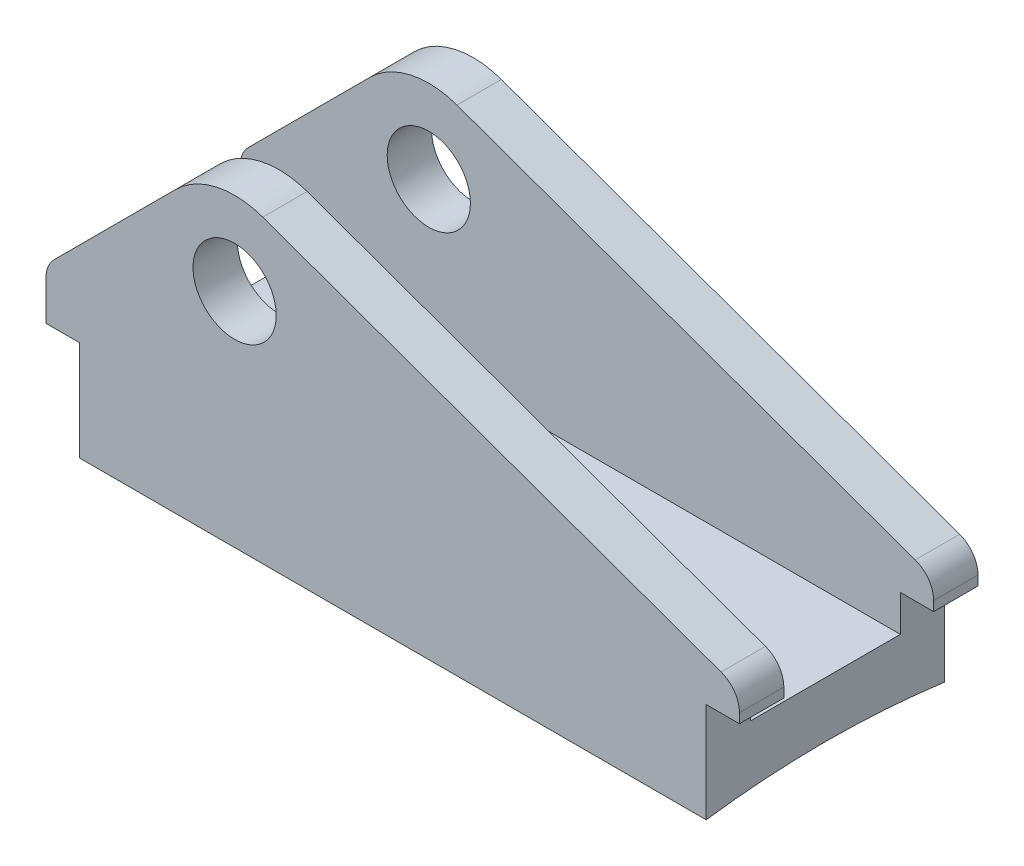
ISO-10303-21;
HEADER;
FILE_DESCRIPTION(('STEP AP214'),'2;1');
FILE_NAME('part.step','',(''),(''),'','','');
FILE_SCHEMA(('AUTOMOTIVE_DESIGN { 1 0 10303 214 1 1 1 1 }'));
ENDSEC;
DATA;
#1=APPLICATION_CONTEXT('core data for automotive mechanical design processes');
#2=APPLICATION_PROTOCOL_DEFINITION('international standard','automotive_design',2000,#1);
#3=PRODUCT_CONTEXT('',#1,'mechanical');
#4=PRODUCT('Part','Part','',(#3));
#5=PRODUCT_RELATED_PRODUCT_CATEGORY('part','',(#4));
#6=PRODUCT_DEFINITION_FORMATION('','',#4);
#7=PRODUCT_DEFINITION_CONTEXT('part definition',#1,'design');
#8=PRODUCT_DEFINITION('design','',#6,#7);
#9=PRODUCT_DEFINITION_SHAPE('','',#8);
#10=(LENGTH_UNIT() NAMED_UNIT(*) SI_UNIT(.MILLI.,.METRE.));
#11=(NAMED_UNIT(*) PLANE_ANGLE_UNIT() SI_UNIT($,.RADIAN.));
#12=(NAMED_UNIT(*) SI_UNIT($,.STERADIAN.) SOLID_ANGLE_UNIT());
#13=UNCERTAINTY_MEASURE_WITH_UNIT(LENGTH_MEASURE(1.E-05),#10,'distance_accuracy_value','');
#14=(GEOMETRIC_REPRESENTATION_CONTEXT(3) GLOBAL_UNCERTAINTY_ASSIGNED_CONTEXT((#13)) GLOBAL_UNIT_ASSIGNED_CONTEXT((#10,
#11,#12)) REPRESENTATION_CONTEXT('',''));
#15=CARTESIAN_POINT('',(0.,0.,0.));
#16=DIRECTION('',(0.,0.,1.));
#17=DIRECTION('',(1.,0.,0.));
#18=AXIS2_PLACEMENT_3D('',#15,#16,#17);
#19=CARTESIAN_POINT('',(62.5,0.,-21.5));
#20=DIRECTION('',(0.,0.,-1.));
#21=DIRECTION('',(0.,1.,0.));
#22=AXIS2_PLACEMENT_3D('',#19,#20,#21);
#23=PLANE('',#22);
#24=CARTESIAN_POINT('',(-28.5,198.548888359395,-21.5));
#25=DIRECTION('',(0.,0.,-1.));
#26=DIRECTION('',(0.,1.,0.));
#27=AXIS2_PLACEMENT_3D('',#24,#25,#26);
#28=CIRCLE('',#27,7.5);
#29=CARTESIAN_POINT('',(-28.5,206.048888359395,-21.5));
#30=VERTEX_POINT('',#29);
#31=EDGE_CURVE('E498',#30,#30,#28,.T.);
#32=ORIENTED_EDGE('',*,*,#31,.F.);
#33=EDGE_LOOP('',(#32));
#34=FACE_BOUND('',#33,.T.);
#35=DIRECTION('',(0.941051981351309,-0.338261981893881,0.));
#36=VECTOR('',#35,1.);
#37=CARTESIAN_POINT('',(120.364104143112,160.979160436887,-21.5));
#38=LINE('',#37,#36);
#39=CARTESIAN_POINT('',(-23.4260702715918,212.664668079665,-21.5));
#40=VERTEX_POINT('',#39);
#41=CARTESIAN_POINT('',(59.1913099094694,182.96777639596,-21.5));
#42=VERTEX_POINT('',#41);
#43=EDGE_CURVE('E432',#40,#42,#38,.T.);
#44=ORIENTED_EDGE('',*,*,#43,.T.);
#45=CARTESIAN_POINT('',(57.5,178.262516489203,-21.5));
#46=DIRECTION('',(0.,0.,-1.));
#47=DIRECTION('',(0.,1.,0.));
#48=AXIS2_PLACEMENT_3D('',#45,#46,#47);
#49=CIRCLE('',#48,5.);
#50=CARTESIAN_POINT('',(62.5,178.262516489203,-21.5));
#51=VERTEX_POINT('',#50);
#52=EDGE_CURVE('E355',#42,#51,#49,.T.);
#53=ORIENTED_EDGE('',*,*,#52,.T.);
#54=DIRECTION('',(0.,-1.,0.));
#55=VECTOR('',#54,1.);
#56=CARTESIAN_POINT('',(62.5,0.,-21.5));
#57=LINE('',#56,#55);
#58=CARTESIAN_POINT('',(62.5,176.548888359395,-21.5));
#59=VERTEX_POINT('',#58);
#60=EDGE_CURVE('E321',#51,#59,#57,.T.);
#61=ORIENTED_EDGE('',*,*,#60,.T.);
#62=DIRECTION('',(1.,0.,0.));
#63=VECTOR('',#62,1.);
#64=CARTESIAN_POINT('',(62.5,176.548888359395,-21.5));
#65=LINE('',#64,#63);
#66=CARTESIAN_POINT('',(56.5,176.548888359395,-21.5));
#67=VERTEX_POINT('',#66);
#68=EDGE_CURVE('E448',#67,#59,#65,.T.);
#69=ORIENTED_EDGE('',*,*,#68,.F.);
#70=DIRECTION('',(0.,-1.,0.));
#71=VECTOR('',#70,1.);
#72=CARTESIAN_POINT('',(56.5,0.,-21.5));
#73=LINE('',#72,#71);
#74=CARTESIAN_POINT('',(56.5,158.548888359395,-21.5));
#75=VERTEX_POINT('',#74);
#76=EDGE_CURVE('E475',#67,#75,#73,.T.);
#77=ORIENTED_EDGE('',*,*,#76,.T.);
#78=DIRECTION('',(-1.,0.,0.));
#79=VECTOR('',#78,1.);
#80=CARTESIAN_POINT('',(62.5,158.548888359395,-21.5));
#81=LINE('',#80,#79);
#82=CARTESIAN_POINT('',(-56.5,158.548888359395,-21.5));
#83=VERTEX_POINT('',#82);
#84=EDGE_CURVE('E330',#75,#83,#81,.T.);
#85=ORIENTED_EDGE('',*,*,#84,.T.);
#86=DIRECTION('',(0.,-1.,0.));
#87=VECTOR('',#86,1.);
#88=CARTESIAN_POINT('',(-56.5,0.,-21.5));
#89=LINE('',#88,#87);
#90=CARTESIAN_POINT('',(-56.5,176.548888359395,-21.5));
#91=VERTEX_POINT('',#90);
#92=EDGE_CURVE('E461',#91,#83,#89,.T.);
#93=ORIENTED_EDGE('',*,*,#92,.F.);
#94=DIRECTION('',(-1.,0.,0.));
#95=VECTOR('',#94,1.);
#96=CARTESIAN_POINT('',(62.5,176.548888359395,-21.5));
#97=LINE('',#96,#95);
#98=CARTESIAN_POINT('',(-62.5,176.548888359395,-21.5));
#99=VERTEX_POINT('',#98);
#100=EDGE_CURVE('E486',#91,#99,#97,.T.);
#101=ORIENTED_EDGE('',*,*,#100,.T.);
#102=DIRECTION('',(0.,-1.,0.));
#103=VECTOR('',#102,1.);
#104=CARTESIAN_POINT('',(-62.5,0.,-21.5));
#105=LINE('',#104,#103);
#106=CARTESIAN_POINT('',(-62.5,183.691023983126,-21.5));
#107=VERTEX_POINT('',#106);
#108=EDGE_CURVE('E307',#107,#99,#105,.T.);
#109=ORIENTED_EDGE('',*,*,#108,.F.);
#110=CARTESIAN_POINT('',(-57.5,183.691023983126,-21.5));
#111=DIRECTION('',(0.,0.,-1.));
#112=DIRECTION('',(0.,1.,0.));
#113=AXIS2_PLACEMENT_3D('',#110,#111,#112);
#114=CIRCLE('',#113,4.99999999999998);
#115=CARTESIAN_POINT('',(-61.0355339059328,187.226557889059,-21.5));
#116=VERTEX_POINT('',#115);
#117=EDGE_CURVE('E373',#107,#116,#114,.T.);
#118=ORIENTED_EDGE('',*,*,#117,.T.);
#119=DIRECTION('',(-0.707106781186543,-0.707106781186552,0.));
#120=VECTOR('',#119,1.);
#121=CARTESIAN_POINT('',(-92.8810458974965,155.381045897495,-21.5));
#122=LINE('',#121,#120);
#123=CARTESIAN_POINT('',(-39.1066017177983,209.155490077193,-21.5));
#124=VERTEX_POINT('',#123);
#125=EDGE_CURVE('E400',#124,#116,#122,.T.);
#126=ORIENTED_EDGE('',*,*,#125,.F.);
#127=CARTESIAN_POINT('',(-28.5,198.548888359395,-21.5));
#128=DIRECTION('',(0.,0.,-1.));
#129=DIRECTION('',(0.,1.,0.));
#130=AXIS2_PLACEMENT_3D('',#127,#128,#129);
#131=CIRCLE('',#130,15.);
#132=EDGE_CURVE('E312',#124,#40,#131,.T.);
#133=ORIENTED_EDGE('',*,*,#132,.T.);
#134=EDGE_LOOP('',(#44,#53,#61,#69,#77,#85,#93,#101,#109,#118,#126,#133));
#135=FACE_BOUND('',#134,.T.);
#136=ADVANCED_FACE('F106',(#34,#135),#23,.T.);
#137=CARTESIAN_POINT('',(62.5,0.,-13.5));
#138=DIRECTION('',(0.,0.,1.));
#139=DIRECTION('',(0.,-1.,0.));
#140=AXIS2_PLACEMENT_3D('',#137,#138,#139);
#141=PLANE('',#140);
#142=CARTESIAN_POINT('',(-28.5,198.548888359395,-13.5));
#143=DIRECTION('',(0.,0.,1.));
#144=DIRECTION('',(0.,-1.,0.));
#145=AXIS2_PLACEMENT_3D('',#142,#143,#144);
#146=CIRCLE('',#145,7.5);
#147=CARTESIAN_POINT('',(-28.5,191.048888359395,-13.5));
#148=VERTEX_POINT('',#147);
#149=EDGE_CURVE('E494',#148,#148,#146,.T.);
#150=ORIENTED_EDGE('',*,*,#149,.F.);
#151=EDGE_LOOP('',(#150));
#152=FACE_BOUND('',#151,.T.);
#153=DIRECTION('',(0.,1.,0.));
#154=VECTOR('',#153,1.);
#155=CARTESIAN_POINT('',(62.5,0.,-13.5));
#156=LINE('',#155,#154);
#157=CARTESIAN_POINT('',(62.5,176.548888359395,-13.5));
#158=VERTEX_POINT('',#157);
#159=CARTESIAN_POINT('',(62.5,178.262516489203,-13.5));
#160=VERTEX_POINT('',#159);
#161=EDGE_CURVE('E303',#158,#160,#156,.T.);
#162=ORIENTED_EDGE('',*,*,#161,.T.);
#163=CARTESIAN_POINT('',(57.5,178.262516489203,-13.5));
#164=DIRECTION('',(0.,0.,1.));
#165=DIRECTION('',(0.,-1.,0.));
#166=AXIS2_PLACEMENT_3D('',#163,#164,#165);
#167=CIRCLE('',#166,5.);
#168=CARTESIAN_POINT('',(59.1913099094694,182.96777639596,-13.5));
#169=VERTEX_POINT('',#168);
#170=EDGE_CURVE('E349',#160,#169,#167,.T.);
#171=ORIENTED_EDGE('',*,*,#170,.T.);
#172=DIRECTION('',(-0.941051981351309,0.338261981893881,0.));
#173=VECTOR('',#172,1.);
#174=CARTESIAN_POINT('',(120.364104143112,160.979160436887,-13.5));
#175=LINE('',#174,#173);
#176=CARTESIAN_POINT('',(-23.4260702715918,212.664668079665,-13.5));
#177=VERTEX_POINT('',#176);
#178=EDGE_CURVE('E434',#169,#177,#175,.T.);
#179=ORIENTED_EDGE('',*,*,#178,.T.);
#180=CARTESIAN_POINT('',(-28.5,198.548888359395,-13.5));
#181=DIRECTION('',(0.,0.,1.));
#182=DIRECTION('',(0.,-1.,0.));
#183=AXIS2_PLACEMENT_3D('',#180,#181,#182);
#184=CIRCLE('',#183,15.);
#185=CARTESIAN_POINT('',(-39.1066017177983,209.155490077193,-13.5));
#186=VERTEX_POINT('',#185);
#187=EDGE_CURVE('E406',#177,#186,#184,.T.);
#188=ORIENTED_EDGE('',*,*,#187,.T.);
#189=DIRECTION('',(0.707106781186543,0.707106781186552,0.));
#190=VECTOR('',#189,1.);
#191=CARTESIAN_POINT('',(-92.8810458974965,155.381045897495,-13.5));
#192=LINE('',#191,#190);
#193=CARTESIAN_POINT('',(-61.0355339059328,187.226557889059,-13.5));
#194=VERTEX_POINT('',#193);
#195=EDGE_CURVE('E383',#194,#186,#192,.T.);
#196=ORIENTED_EDGE('',*,*,#195,.F.);
#197=CARTESIAN_POINT('',(-57.5,183.691023983126,-13.5));
#198=DIRECTION('',(0.,0.,1.));
#199=DIRECTION('',(0.,-1.,0.));
#200=AXIS2_PLACEMENT_3D('',#197,#198,#199);
#201=CIRCLE('',#200,4.99999999999998);
#202=CARTESIAN_POINT('',(-62.5,183.691023983126,-13.5));
#203=VERTEX_POINT('',#202);
#204=EDGE_CURVE('E370',#194,#203,#201,.T.);
#205=ORIENTED_EDGE('',*,*,#204,.T.);
#206=DIRECTION('',(0.,1.,0.));
#207=VECTOR('',#206,1.);
#208=CARTESIAN_POINT('',(-62.5,0.,-13.5));
#209=LINE('',#208,#207);
#210=CARTESIAN_POINT('',(-62.5,176.548888359395,-13.5));
#211=VERTEX_POINT('',#210);
#212=EDGE_CURVE('E311',#211,#203,#209,.T.);
#213=ORIENTED_EDGE('',*,*,#212,.F.);
#214=DIRECTION('',(1.,0.,0.));
#215=VECTOR('',#214,1.);
#216=CARTESIAN_POINT('',(62.5,176.548888359395,-13.5));
#217=LINE('',#216,#215);
#218=CARTESIAN_POINT('',(-56.5,176.548888359395,-13.5));
#219=VERTEX_POINT('',#218);
#220=EDGE_CURVE('E483',#211,#219,#217,.T.);
#221=ORIENTED_EDGE('',*,*,#220,.T.);
#222=DIRECTION('',(0.,1.,0.));
#223=VECTOR('',#222,1.);
#224=CARTESIAN_POINT('',(-56.5,0.,-13.5));
#225=LINE('',#224,#223);
#226=CARTESIAN_POINT('',(-56.5,170.,-13.5));
#227=VERTEX_POINT('',#226);
#228=EDGE_CURVE('E455',#227,#219,#225,.T.);
#229=ORIENTED_EDGE('',*,*,#228,.F.);
#230=DIRECTION('',(-1.,0.,0.));
#231=VECTOR('',#230,1.);
#232=CARTESIAN_POINT('',(62.5,170.,-13.5));
#233=LINE('',#232,#231);
#234=CARTESIAN_POINT('',(56.5,170.,-13.5));
#235=VERTEX_POINT('',#234);
#236=EDGE_CURVE('E326',#235,#227,#233,.T.);
#237=ORIENTED_EDGE('',*,*,#236,.F.);
#238=DIRECTION('',(0.,1.,0.));
#239=VECTOR('',#238,1.);
#240=CARTESIAN_POINT('',(56.5,0.,-13.5));
#241=LINE('',#240,#239);
#242=CARTESIAN_POINT('',(56.5,176.548888359395,-13.5));
#243=VERTEX_POINT('',#242);
#244=EDGE_CURVE('E468',#235,#243,#241,.T.);
#245=ORIENTED_EDGE('',*,*,#244,.T.);
#246=DIRECTION('',(-1.,0.,0.));
#247=VECTOR('',#246,1.);
#248=CARTESIAN_POINT('',(62.5,176.548888359395,-13.5));
#249=LINE('',#248,#247);
#250=EDGE_CURVE('E417',#158,#243,#249,.T.);
#251=ORIENTED_EDGE('',*,*,#250,.F.);
#252=EDGE_LOOP('',(#162,#171,#179,#188,#196,#205,#213,#221,#229,#237,#245,#251));
#253=FACE_BOUND('',#252,.T.);
#254=ADVANCED_FACE('F380',(#152,#253),#141,.T.);
#255=CARTESIAN_POINT('',(62.5,0.,13.5));
#256=DIRECTION('',(0.,0.,-1.));
#257=DIRECTION('',(-1.,0.,0.));
#258=AXIS2_PLACEMENT_3D('',#255,#256,#257);
#259=PLANE('',#258);
#260=CARTESIAN_POINT('',(-28.5,198.548888359395,13.5));
#261=DIRECTION('',(0.,0.,-1.));
#262=DIRECTION('',(-1.,0.,0.));
#263=AXIS2_PLACEMENT_3D('',#260,#261,#262);
#264=CIRCLE('',#263,7.5);
#265=CARTESIAN_POINT('',(-36.,198.548888359395,13.5));
#266=VERTEX_POINT('',#265);
#267=EDGE_CURVE('E490',#266,#266,#264,.T.);
#268=ORIENTED_EDGE('',*,*,#267,.F.);
#269=EDGE_LOOP('',(#268));
#270=FACE_BOUND('',#269,.T.);
#271=DIRECTION('',(0.941051981351309,-0.338261981893881,0.));
#272=VECTOR('',#271,1.);
#273=CARTESIAN_POINT('',(120.364104143112,160.979160436887,13.5));
#274=LINE('',#273,#272);
#275=CARTESIAN_POINT('',(-23.4260702715918,212.664668079665,13.5));
#276=VERTEX_POINT('',#275);
#277=CARTESIAN_POINT('',(59.1913099094694,182.96777639596,13.5));
#278=VERTEX_POINT('',#277);
#279=EDGE_CURVE('E442',#276,#278,#274,.T.);
#280=ORIENTED_EDGE('',*,*,#279,.T.);
#281=CARTESIAN_POINT('',(57.5,178.262516489203,13.5));
#282=DIRECTION('',(0.,0.,-1.));
#283=DIRECTION('',(-1.,0.,0.));
#284=AXIS2_PLACEMENT_3D('',#281,#282,#283);
#285=CIRCLE('',#284,5.);
#286=CARTESIAN_POINT('',(62.5,178.262516489203,13.5));
#287=VERTEX_POINT('',#286);
#288=EDGE_CURVE('E12',#278,#287,#285,.T.);
#289=ORIENTED_EDGE('',*,*,#288,.T.);
#290=DIRECTION('',(0.,-1.,0.));
#291=VECTOR('',#290,1.);
#292=CARTESIAN_POINT('',(62.5,0.,13.5));
#293=LINE('',#292,#291);
#294=CARTESIAN_POINT('',(62.5,176.548888359395,13.5));
#295=VERTEX_POINT('',#294);
#296=EDGE_CURVE('E296',#287,#295,#293,.T.);
#297=ORIENTED_EDGE('',*,*,#296,.T.);
#298=DIRECTION('',(1.,0.,0.));
#299=VECTOR('',#298,1.);
#300=CARTESIAN_POINT('',(62.5,176.548888359395,13.5));
#301=LINE('',#300,#299);
#302=CARTESIAN_POINT('',(56.5,176.548888359395,13.5));
#303=VERTEX_POINT('',#302);
#304=EDGE_CURVE('E275',#303,#295,#301,.T.);
#305=ORIENTED_EDGE('',*,*,#304,.F.);
#306=DIRECTION('',(0.,-1.,0.));
#307=VECTOR('',#306,1.);
#308=CARTESIAN_POINT('',(56.5,0.,13.5));
#309=LINE('',#308,#307);
#310=CARTESIAN_POINT('',(56.5,170.,13.5));
#311=VERTEX_POINT('',#310);
#312=EDGE_CURVE('E464',#303,#311,#309,.T.);
#313=ORIENTED_EDGE('',*,*,#312,.T.);
#314=DIRECTION('',(-1.,0.,0.));
#315=VECTOR('',#314,1.);
#316=CARTESIAN_POINT('',(62.5,170.,13.5));
#317=LINE('',#316,#315);
#318=CARTESIAN_POINT('',(-56.5,170.,13.5));
#319=VERTEX_POINT('',#318);
#320=EDGE_CURVE('E301',#311,#319,#317,.T.);
#321=ORIENTED_EDGE('',*,*,#320,.T.);
#322=DIRECTION('',(0.,-1.,0.));
#323=VECTOR('',#322,1.);
#324=CARTESIAN_POINT('',(-56.5,0.,13.5));
#325=LINE('',#324,#323);
#326=CARTESIAN_POINT('',(-56.5,176.548888359395,13.5));
#327=VERTEX_POINT('',#326);
#328=EDGE_CURVE('E452',#327,#319,#325,.T.);
#329=ORIENTED_EDGE('',*,*,#328,.F.);
#330=DIRECTION('',(-1.,0.,0.));
#331=VECTOR('',#330,1.);
#332=CARTESIAN_POINT('',(62.5,176.548888359395,13.5));
#333=LINE('',#332,#331);
#334=CARTESIAN_POINT('',(-62.5,176.548888359395,13.5));
#335=VERTEX_POINT('',#334);
#336=EDGE_CURVE('E479',#327,#335,#333,.T.);
#337=ORIENTED_EDGE('',*,*,#336,.T.);
#338=DIRECTION('',(0.,-1.,0.));
#339=VECTOR('',#338,1.);
#340=CARTESIAN_POINT('',(-62.5,0.,13.5));
#341=LINE('',#340,#339);
#342=CARTESIAN_POINT('',(-62.5,183.691023983126,13.5));
#343=VERTEX_POINT('',#342);
#344=EDGE_CURVE('E315',#343,#335,#341,.T.);
#345=ORIENTED_EDGE('',*,*,#344,.F.);
#346=CARTESIAN_POINT('',(-57.5,183.691023983126,13.5));
#347=DIRECTION('',(0.,0.,-1.));
#348=DIRECTION('',(-1.,0.,0.));
#349=AXIS2_PLACEMENT_3D('',#346,#347,#348);
#350=CIRCLE('',#349,4.99999999999998);
#351=CARTESIAN_POINT('',(-61.0355339059328,187.226557889059,13.5));
#352=VERTEX_POINT('',#351);
#353=EDGE_CURVE('E385',#343,#352,#350,.T.);
#354=ORIENTED_EDGE('',*,*,#353,.T.);
#355=DIRECTION('',(-0.707106781186543,-0.707106781186552,0.));
#356=VECTOR('',#355,1.);
#357=CARTESIAN_POINT('',(-92.8810458974965,155.381045897495,13.5));
#358=LINE('',#357,#356);
#359=CARTESIAN_POINT('',(-39.1066017177983,209.155490077193,13.5));
#360=VERTEX_POINT('',#359);
#361=EDGE_CURVE('E389',#360,#352,#358,.T.);
#362=ORIENTED_EDGE('',*,*,#361,.F.);
#363=CARTESIAN_POINT('',(-28.5,198.548888359395,13.5));
#364=DIRECTION('',(0.,0.,-1.));
#365=DIRECTION('',(-1.,0.,0.));
#366=AXIS2_PLACEMENT_3D('',#363,#364,#365);
#367=CIRCLE('',#366,15.);
#368=EDGE_CURVE('E403',#360,#276,#367,.T.);
#369=ORIENTED_EDGE('',*,*,#368,.T.);
#370=EDGE_LOOP('',(#280,#289,#297,#305,#313,#321,#329,#337,#345,#354,#362,#369));
#371=FACE_BOUND('',#370,.T.);
#372=ADVANCED_FACE('F577',(#270,#371),#259,.T.);
#373=CARTESIAN_POINT('',(62.5,0.,21.5));
#374=DIRECTION('',(0.,0.,1.));
#375=DIRECTION('',(1.,0.,0.));
#376=AXIS2_PLACEMENT_3D('',#373,#374,#375);
#377=PLANE('',#376);
#378=CARTESIAN_POINT('',(-28.5,198.548888359395,21.5));
#379=DIRECTION('',(0.,0.,1.));
#380=DIRECTION('',(1.,0.,0.));
#381=AXIS2_PLACEMENT_3D('',#378,#379,#380);
#382=CIRCLE('',#381,7.5);
#383=CARTESIAN_POINT('',(-21.,198.548888359395,21.5));
#384=VERTEX_POINT('',#383);
#385=EDGE_CURVE('E541',#384,#384,#382,.T.);
#386=ORIENTED_EDGE('',*,*,#385,.F.);
#387=EDGE_LOOP('',(#386));
#388=FACE_BOUND('',#387,.T.);
#389=DIRECTION('',(0.,1.,0.));
#390=VECTOR('',#389,1.);
#391=CARTESIAN_POINT('',(62.5,0.,21.5));
#392=LINE('',#391,#390);
#393=CARTESIAN_POINT('',(62.5,176.548888359395,21.5));
#394=VERTEX_POINT('',#393);
#395=CARTESIAN_POINT('',(62.5,178.262516489203,21.5));
#396=VERTEX_POINT('',#395);
#397=EDGE_CURVE('E284',#394,#396,#392,.T.);
#398=ORIENTED_EDGE('',*,*,#397,.T.);
#399=CARTESIAN_POINT('',(57.5,178.262516489203,21.5));
#400=DIRECTION('',(0.,0.,1.));
#401=DIRECTION('',(1.,0.,0.));
#402=AXIS2_PLACEMENT_3D('',#399,#400,#401);
#403=CIRCLE('',#402,5.);
#404=CARTESIAN_POINT('',(59.1913099094694,182.96777639596,21.5));
#405=VERTEX_POINT('',#404);
#406=EDGE_CURVE('E129',#396,#405,#403,.T.);
#407=ORIENTED_EDGE('',*,*,#406,.T.);
#408=DIRECTION('',(-0.941051981351309,0.338261981893881,0.));
#409=VECTOR('',#408,1.);
#410=CARTESIAN_POINT('',(65.0154271677859,180.874292204203,21.5));
#411=LINE('',#410,#409);
#412=CARTESIAN_POINT('',(-23.4260702715918,212.664668079665,21.5));
#413=VERTEX_POINT('',#412);
#414=EDGE_CURVE('E553',#405,#413,#411,.T.);
#415=ORIENTED_EDGE('',*,*,#414,.T.);
#416=CARTESIAN_POINT('',(-28.5,198.548888359395,21.5));
#417=DIRECTION('',(0.,0.,1.));
#418=DIRECTION('',(1.,0.,0.));
#419=AXIS2_PLACEMENT_3D('',#416,#417,#418);
#420=CIRCLE('',#419,15.);
#421=CARTESIAN_POINT('',(-39.1066017177983,209.155490077193,21.5));
#422=VERTEX_POINT('',#421);
#423=EDGE_CURVE('E510',#413,#422,#420,.T.);
#424=ORIENTED_EDGE('',*,*,#423,.T.);
#425=DIRECTION('',(0.707106781186543,0.707106781186552,0.));
#426=VECTOR('',#425,1.);
#427=CARTESIAN_POINT('',(-124.131045897496,124.131045897495,21.5));
#428=LINE('',#427,#426);
#429=CARTESIAN_POINT('',(-61.0355339059328,187.226557889059,21.5));
#430=VERTEX_POINT('',#429);
#431=EDGE_CURVE('E506',#430,#422,#428,.T.);
#432=ORIENTED_EDGE('',*,*,#431,.F.);
#433=CARTESIAN_POINT('',(-57.5,183.691023983126,21.5));
#434=DIRECTION('',(0.,0.,1.));
#435=DIRECTION('',(1.,0.,0.));
#436=AXIS2_PLACEMENT_3D('',#433,#434,#435);
#437=CIRCLE('',#436,4.99999999999998);
#438=CARTESIAN_POINT('',(-62.5,183.691023983126,21.5));
#439=VERTEX_POINT('',#438);
#440=EDGE_CURVE('E502',#430,#439,#437,.T.);
#441=ORIENTED_EDGE('',*,*,#440,.T.);
#442=DIRECTION('',(0.,1.,0.));
#443=VECTOR('',#442,1.);
#444=CARTESIAN_POINT('',(-62.5,0.,21.5));
#445=LINE('',#444,#443);
#446=CARTESIAN_POINT('',(-62.5,176.548888359395,21.5));
#447=VERTEX_POINT('',#446);
#448=EDGE_CURVE('E319',#447,#439,#445,.T.);
#449=ORIENTED_EDGE('',*,*,#448,.F.);
#450=DIRECTION('',(1.,0.,0.));
#451=VECTOR('',#450,1.);
#452=CARTESIAN_POINT('',(0.,176.548888359395,21.5));
#453=LINE('',#452,#451);
#454=CARTESIAN_POINT('',(-56.5,176.548888359395,21.5));
#455=VERTEX_POINT('',#454);
#456=EDGE_CURVE('E544',#447,#455,#453,.T.);
#457=ORIENTED_EDGE('',*,*,#456,.T.);
#458=DIRECTION('',(0.,1.,0.));
#459=VECTOR('',#458,1.);
#460=CARTESIAN_POINT('',(-56.5,0.,21.5));
#461=LINE('',#460,#459);
#462=CARTESIAN_POINT('',(-56.5,158.548888359395,21.5));
#463=VERTEX_POINT('',#462);
#464=EDGE_CURVE('E548',#463,#455,#461,.T.);
#465=ORIENTED_EDGE('',*,*,#464,.F.);
#466=DIRECTION('',(-1.,0.,0.));
#467=VECTOR('',#466,1.);
#468=CARTESIAN_POINT('',(62.5,158.548888359395,21.5));
#469=LINE('',#468,#467);
#470=CARTESIAN_POINT('',(56.5,158.548888359395,21.5));
#471=VERTEX_POINT('',#470);
#472=EDGE_CURVE('E295',#471,#463,#469,.T.);
#473=ORIENTED_EDGE('',*,*,#472,.F.);
#474=DIRECTION('',(0.,1.,0.));
#475=VECTOR('',#474,1.);
#476=CARTESIAN_POINT('',(56.5,158.548888359395,21.5));
#477=LINE('',#476,#475);
#478=CARTESIAN_POINT('',(56.5,176.548888359395,21.5));
#479=VERTEX_POINT('',#478);
#480=EDGE_CURVE('E286',#471,#479,#477,.T.);
#481=ORIENTED_EDGE('',*,*,#480,.T.);
#482=DIRECTION('',(-1.,0.,0.));
#483=VECTOR('',#482,1.);
#484=CARTESIAN_POINT('',(62.5,176.548888359395,21.5));
#485=LINE('',#484,#483);
#486=EDGE_CURVE('E272',#394,#479,#485,.T.);
#487=ORIENTED_EDGE('',*,*,#486,.F.);
#488=EDGE_LOOP('',(#398,#407,#415,#424,#432,#441,#449,#457,#465,#473,#481,#487));
#489=FACE_BOUND('',#488,.T.);
#490=ADVANCED_FACE('F283',(#388,#489),#377,.T.);
#491=CARTESIAN_POINT('',(-62.5,0.,0.));
#492=DIRECTION('',(1.,0.,0.));
#493=DIRECTION('',(0.,0.,-1.));
#494=AXIS2_PLACEMENT_3D('',#491,#492,#493);
#495=PLANE('',#494);
#496=DIRECTION('',(0.,0.,1.));
#497=VECTOR('',#496,1.);
#498=CARTESIAN_POINT('',(-62.5,176.548888359395,-103.5));
#499=LINE('',#498,#497);
#500=EDGE_CURVE('E534',#335,#447,#499,.T.);
#501=ORIENTED_EDGE('',*,*,#500,.T.);
#502=ORIENTED_EDGE('',*,*,#448,.T.);
#503=DIRECTION('',(0.,0.,1.));
#504=VECTOR('',#503,1.);
#505=CARTESIAN_POINT('',(-62.5,183.691023983126,-103.5));
#506=LINE('',#505,#504);
#507=EDGE_CURVE('E334',#343,#439,#506,.T.);
#508=ORIENTED_EDGE('',*,*,#507,.F.);
#509=ORIENTED_EDGE('',*,*,#344,.T.);
#510=EDGE_LOOP('',(#501,#502,#508,#509));
#511=FACE_BOUND('',#510,.T.);
#512=ADVANCED_FACE('F576',(#511),#495,.F.);
#513=EDGE_CURVE('E530',#99,#211,#499,.T.);
#514=ORIENTED_EDGE('',*,*,#513,.T.);
#515=ORIENTED_EDGE('',*,*,#212,.T.);
#516=EDGE_CURVE('E281',#107,#203,#506,.T.);
#517=ORIENTED_EDGE('',*,*,#516,.F.);
#518=ORIENTED_EDGE('',*,*,#108,.T.);
#519=EDGE_LOOP('',(#514,#515,#517,#518));
#520=FACE_BOUND('',#519,.T.);
#521=ADVANCED_FACE('F529',(#520),#495,.F.);
#522=CARTESIAN_POINT('',(62.5,0.,0.));
#523=DIRECTION('',(-1.,0.,0.));
#524=DIRECTION('',(0.,0.,1.));
#525=AXIS2_PLACEMENT_3D('',#522,#523,#524);
#526=CYLINDRICAL_SURFACE('',#525,160.);
#527=ORIENTED_EDGE('',*,*,#84,.F.);
#528=CARTESIAN_POINT('',(56.5,0.,0.));
#529=DIRECTION('',(1.,0.,0.));
#530=DIRECTION('',(0.,0.,-1.));
#531=AXIS2_PLACEMENT_3D('',#528,#529,#530);
#532=CIRCLE('',#531,160.);
#533=EDGE_CURVE('E471',#75,#471,#532,.T.);
#534=ORIENTED_EDGE('',*,*,#533,.T.);
#535=ORIENTED_EDGE('',*,*,#472,.T.);
#536=CARTESIAN_POINT('',(-56.5,0.,0.));
#537=DIRECTION('',(1.,0.,0.));
#538=DIRECTION('',(0.,0.,-1.));
#539=AXIS2_PLACEMENT_3D('',#536,#537,#538);
#540=CIRCLE('',#539,160.);
#541=EDGE_CURVE('E458',#83,#463,#540,.T.);
#542=ORIENTED_EDGE('',*,*,#541,.F.);
#543=EDGE_LOOP('',(#527,#534,#535,#542));
#544=FACE_BOUND('',#543,.T.);
#545=ADVANCED_FACE('F598',(#544),#526,.F.);
#546=CARTESIAN_POINT('',(62.5,170.,0.));
#547=DIRECTION('',(0.,1.,0.));
#548=DIRECTION('',(0.,0.,1.));
#549=AXIS2_PLACEMENT_3D('',#546,#547,#548);
#550=PLANE('',#549);
#551=ORIENTED_EDGE('',*,*,#320,.F.);
#552=DIRECTION('',(0.,0.,-1.));
#553=VECTOR('',#552,1.);
#554=CARTESIAN_POINT('',(56.5,170.,0.));
#555=LINE('',#554,#553);
#556=EDGE_CURVE('E341',#311,#235,#555,.T.);
#557=ORIENTED_EDGE('',*,*,#556,.T.);
#558=ORIENTED_EDGE('',*,*,#236,.T.);
#559=DIRECTION('',(0.,0.,-1.));
#560=VECTOR('',#559,1.);
#561=CARTESIAN_POINT('',(-56.5,170.,0.));
#562=LINE('',#561,#560);
#563=EDGE_CURVE('E338',#319,#227,#562,.T.);
#564=ORIENTED_EDGE('',*,*,#563,.F.);
#565=EDGE_LOOP('',(#551,#557,#558,#564));
#566=FACE_BOUND('',#565,.T.);
#567=ADVANCED_FACE('F600',(#566),#550,.T.);
#568=CARTESIAN_POINT('',(62.5,0.,0.));
#569=DIRECTION('',(1.,0.,0.));
#570=DIRECTION('',(0.,0.,-1.));
#571=AXIS2_PLACEMENT_3D('',#568,#569,#570);
#572=PLANE('',#571);
#573=ORIENTED_EDGE('',*,*,#60,.F.);
#574=DIRECTION('',(0.,0.,1.));
#575=VECTOR('',#574,1.);
#576=CARTESIAN_POINT('',(62.5,178.262516489203,0.));
#577=LINE('',#576,#575);
#578=EDGE_CURVE('E345',#51,#160,#577,.T.);
#579=ORIENTED_EDGE('',*,*,#578,.T.);
#580=ORIENTED_EDGE('',*,*,#161,.F.);
#581=DIRECTION('',(0.,0.,1.));
#582=VECTOR('',#581,1.);
#583=CARTESIAN_POINT('',(62.5,176.548888359395,0.));
#584=LINE('',#583,#582);
#585=EDGE_CURVE('E280',#59,#158,#584,.T.);
#586=ORIENTED_EDGE('',*,*,#585,.F.);
#587=EDGE_LOOP('',(#573,#579,#580,#586));
#588=FACE_BOUND('',#587,.T.);
#589=ADVANCED_FACE('F421',(#588),#572,.T.);
#590=ORIENTED_EDGE('',*,*,#296,.F.);
#591=DIRECTION('',(0.,0.,1.));
#592=VECTOR('',#591,1.);
#593=CARTESIAN_POINT('',(62.5,178.262516489203,0.));
#594=LINE('',#593,#592);
#595=EDGE_CURVE('E293',#287,#396,#594,.T.);
#596=ORIENTED_EDGE('',*,*,#595,.T.);
#597=ORIENTED_EDGE('',*,*,#397,.F.);
#598=EDGE_CURVE('E268',#295,#394,#584,.T.);
#599=ORIENTED_EDGE('',*,*,#598,.F.);
#600=EDGE_LOOP('',(#590,#596,#597,#599));
#601=FACE_BOUND('',#600,.T.);
#602=ADVANCED_FACE('F291',(#601),#572,.T.);
#603=CARTESIAN_POINT('',(-57.5,183.691023983126,-103.5));
#604=DIRECTION('',(0.,0.,1.));
#605=DIRECTION('',(1.,0.,0.));
#606=AXIS2_PLACEMENT_3D('',#603,#604,#605);
#607=CYLINDRICAL_SURFACE('',#606,4.99999999999998);
#608=ORIENTED_EDGE('',*,*,#507,.T.);
#609=ORIENTED_EDGE('',*,*,#440,.F.);
#610=DIRECTION('',(0.,0.,1.));
#611=VECTOR('',#610,1.);
#612=CARTESIAN_POINT('',(-61.0355339059328,187.226557889059,-103.5));
#613=LINE('',#612,#611);
#614=EDGE_CURVE('E514',#352,#430,#613,.T.);
#615=ORIENTED_EDGE('',*,*,#614,.F.);
#616=ORIENTED_EDGE('',*,*,#353,.F.);
#617=EDGE_LOOP('',(#608,#609,#615,#616));
#618=FACE_BOUND('',#617,.T.);
#619=ADVANCED_FACE('F644',(#618),#607,.T.);
#620=CARTESIAN_POINT('',(-124.131045897496,124.131045897495,-103.5));
#621=DIRECTION('',(0.707106781186552,-0.707106781186543,0.));
#622=DIRECTION('',(0.707106781186543,0.707106781186552,0.));
#623=AXIS2_PLACEMENT_3D('',#620,#621,#622);
#624=PLANE('',#623);
#625=ORIENTED_EDGE('',*,*,#361,.T.);
#626=ORIENTED_EDGE('',*,*,#614,.T.);
#627=ORIENTED_EDGE('',*,*,#431,.T.);
#628=DIRECTION('',(0.,0.,1.));
#629=VECTOR('',#628,1.);
#630=CARTESIAN_POINT('',(-39.1066017177983,209.155490077193,-103.5));
#631=LINE('',#630,#629);
#632=EDGE_CURVE('E515',#360,#422,#631,.T.);
#633=ORIENTED_EDGE('',*,*,#632,.F.);
#634=EDGE_LOOP('',(#625,#626,#627,#633));
#635=FACE_BOUND('',#634,.T.);
#636=ADVANCED_FACE('F640',(#635),#624,.F.);
#637=CARTESIAN_POINT('',(-28.5,198.548888359395,-103.5));
#638=DIRECTION('',(0.,0.,1.));
#639=DIRECTION('',(1.,0.,0.));
#640=AXIS2_PLACEMENT_3D('',#637,#638,#639);
#641=CYLINDRICAL_SURFACE('',#640,15.);
#642=ORIENTED_EDGE('',*,*,#632,.T.);
#643=ORIENTED_EDGE('',*,*,#423,.F.);
#644=DIRECTION('',(0.,0.,1.));
#645=VECTOR('',#644,1.);
#646=CARTESIAN_POINT('',(-23.4260702715918,212.664668079665,-103.5));
#647=LINE('',#646,#645);
#648=EDGE_CURVE('E551',#276,#413,#647,.T.);
#649=ORIENTED_EDGE('',*,*,#648,.F.);
#650=ORIENTED_EDGE('',*,*,#368,.F.);
#651=EDGE_LOOP('',(#642,#643,#649,#650));
#652=FACE_BOUND('',#651,.T.);
#653=ADVANCED_FACE('F636',(#652),#641,.T.);
#654=EDGE_CURVE('E392',#124,#186,#631,.T.);
#655=ORIENTED_EDGE('',*,*,#654,.T.);
#656=ORIENTED_EDGE('',*,*,#187,.F.);
#657=EDGE_CURVE('E557',#40,#177,#647,.T.);
#658=ORIENTED_EDGE('',*,*,#657,.F.);
#659=ORIENTED_EDGE('',*,*,#132,.F.);
#660=EDGE_LOOP('',(#655,#656,#658,#659));
#661=FACE_BOUND('',#660,.T.);
#662=ADVANCED_FACE('F639',(#661),#641,.T.);
#663=ORIENTED_EDGE('',*,*,#125,.T.);
#664=EDGE_CURVE('E517',#116,#194,#613,.T.);
#665=ORIENTED_EDGE('',*,*,#664,.T.);
#666=ORIENTED_EDGE('',*,*,#195,.T.);
#667=ORIENTED_EDGE('',*,*,#654,.F.);
#668=EDGE_LOOP('',(#663,#665,#666,#667));
#669=FACE_BOUND('',#668,.T.);
#670=ADVANCED_FACE('F524',(#669),#624,.F.);
#671=ORIENTED_EDGE('',*,*,#516,.T.);
#672=ORIENTED_EDGE('',*,*,#204,.F.);
#673=ORIENTED_EDGE('',*,*,#664,.F.);
#674=ORIENTED_EDGE('',*,*,#117,.F.);
#675=EDGE_LOOP('',(#671,#672,#673,#674));
#676=FACE_BOUND('',#675,.T.);
#677=ADVANCED_FACE('F368',(#676),#607,.T.);
#678=CARTESIAN_POINT('',(65.0154271677859,180.874292204203,-103.5));
#679=DIRECTION('',(0.338261981893881,0.941051981351309,0.));
#680=DIRECTION('',(-0.941051981351309,0.338261981893881,0.));
#681=AXIS2_PLACEMENT_3D('',#678,#679,#680);
#682=PLANE('',#681);
#683=ORIENTED_EDGE('',*,*,#178,.F.);
#684=DIRECTION('',(0.,0.,1.));
#685=VECTOR('',#684,1.);
#686=CARTESIAN_POINT('',(59.1913099094694,182.96777639596,-103.5));
#687=LINE('',#686,#685);
#688=EDGE_CURVE('E352',#169,#42,#687,.F.);
#689=ORIENTED_EDGE('',*,*,#688,.T.);
#690=ORIENTED_EDGE('',*,*,#43,.F.);
#691=ORIENTED_EDGE('',*,*,#657,.T.);
#692=EDGE_LOOP('',(#683,#689,#690,#691));
#693=FACE_BOUND('',#692,.T.);
#694=ADVANCED_FACE('F430',(#693),#682,.T.);
#695=ORIENTED_EDGE('',*,*,#414,.F.);
#696=DIRECTION('',(0.,0.,1.));
#697=VECTOR('',#696,1.);
#698=CARTESIAN_POINT('',(59.1913099094694,182.96777639596,-103.5));
#699=LINE('',#698,#697);
#700=EDGE_CURVE('E115',#405,#278,#699,.F.);
#701=ORIENTED_EDGE('',*,*,#700,.T.);
#702=ORIENTED_EDGE('',*,*,#279,.F.);
#703=ORIENTED_EDGE('',*,*,#648,.T.);
#704=EDGE_LOOP('',(#695,#701,#702,#703));
#705=FACE_BOUND('',#704,.T.);
#706=ADVANCED_FACE('F626',(#705),#682,.T.);
#707=CARTESIAN_POINT('',(62.5,176.548888359395,-103.5));
#708=DIRECTION('',(0.,1.,0.));
#709=DIRECTION('',(0.,0.,1.));
#710=AXIS2_PLACEMENT_3D('',#707,#708,#709);
#711=PLANE('',#710);
#712=ORIENTED_EDGE('',*,*,#68,.T.);
#713=ORIENTED_EDGE('',*,*,#585,.T.);
#714=ORIENTED_EDGE('',*,*,#250,.T.);
#715=DIRECTION('',(0.,0.,1.));
#716=VECTOR('',#715,1.);
#717=CARTESIAN_POINT('',(56.5,176.548888359395,-103.5));
#718=LINE('',#717,#716);
#719=EDGE_CURVE('E288',#67,#243,#718,.T.);
#720=ORIENTED_EDGE('',*,*,#719,.F.);
#721=EDGE_LOOP('',(#712,#713,#714,#720));
#722=FACE_BOUND('',#721,.T.);
#723=ADVANCED_FACE('F621',(#722),#711,.F.);
#724=CARTESIAN_POINT('',(56.5,158.548888359395,-103.5));
#725=DIRECTION('',(1.,0.,0.));
#726=DIRECTION('',(0.,0.,-1.));
#727=AXIS2_PLACEMENT_3D('',#724,#725,#726);
#728=PLANE('',#727);
#729=ORIENTED_EDGE('',*,*,#719,.T.);
#730=ORIENTED_EDGE('',*,*,#244,.F.);
#731=ORIENTED_EDGE('',*,*,#556,.F.);
#732=ORIENTED_EDGE('',*,*,#312,.F.);
#733=EDGE_CURVE('E566',#303,#479,#718,.T.);
#734=ORIENTED_EDGE('',*,*,#733,.T.);
#735=ORIENTED_EDGE('',*,*,#480,.F.);
#736=ORIENTED_EDGE('',*,*,#533,.F.);
#737=ORIENTED_EDGE('',*,*,#76,.F.);
#738=EDGE_LOOP('',(#729,#730,#731,#732,#734,#735,#736,#737));
#739=FACE_BOUND('',#738,.T.);
#740=ADVANCED_FACE('F618',(#739),#728,.T.);
#741=ORIENTED_EDGE('',*,*,#304,.T.);
#742=ORIENTED_EDGE('',*,*,#598,.T.);
#743=ORIENTED_EDGE('',*,*,#486,.T.);
#744=ORIENTED_EDGE('',*,*,#733,.F.);
#745=EDGE_LOOP('',(#741,#742,#743,#744));
#746=FACE_BOUND('',#745,.T.);
#747=ADVANCED_FACE('F270',(#746),#711,.F.);
#748=CARTESIAN_POINT('',(0.,176.548888359395,-103.5));
#749=DIRECTION('',(0.,-1.,0.));
#750=DIRECTION('',(0.,0.,-1.));
#751=AXIS2_PLACEMENT_3D('',#748,#749,#750);
#752=PLANE('',#751);
#753=DIRECTION('',(0.,0.,1.));
#754=VECTOR('',#753,1.);
#755=CARTESIAN_POINT('',(-56.5,176.548888359395,-103.5));
#756=LINE('',#755,#754);
#757=EDGE_CURVE('E538',#91,#219,#756,.T.);
#758=ORIENTED_EDGE('',*,*,#757,.T.);
#759=ORIENTED_EDGE('',*,*,#220,.F.);
#760=ORIENTED_EDGE('',*,*,#513,.F.);
#761=ORIENTED_EDGE('',*,*,#100,.F.);
#762=EDGE_LOOP('',(#758,#759,#760,#761));
#763=FACE_BOUND('',#762,.T.);
#764=ADVANCED_FACE('F625',(#763),#752,.T.);
#765=EDGE_CURVE('E533',#327,#455,#756,.T.);
#766=ORIENTED_EDGE('',*,*,#765,.T.);
#767=ORIENTED_EDGE('',*,*,#456,.F.);
#768=ORIENTED_EDGE('',*,*,#500,.F.);
#769=ORIENTED_EDGE('',*,*,#336,.F.);
#770=EDGE_LOOP('',(#766,#767,#768,#769));
#771=FACE_BOUND('',#770,.T.);
#772=ADVANCED_FACE('F631',(#771),#752,.T.);
#773=CARTESIAN_POINT('',(-56.5,0.,-103.5));
#774=DIRECTION('',(1.,0.,0.));
#775=DIRECTION('',(0.,0.,-1.));
#776=AXIS2_PLACEMENT_3D('',#773,#774,#775);
#777=PLANE('',#776);
#778=ORIENTED_EDGE('',*,*,#92,.T.);
#779=ORIENTED_EDGE('',*,*,#541,.T.);
#780=ORIENTED_EDGE('',*,*,#464,.T.);
#781=ORIENTED_EDGE('',*,*,#765,.F.);
#782=ORIENTED_EDGE('',*,*,#328,.T.);
#783=ORIENTED_EDGE('',*,*,#563,.T.);
#784=ORIENTED_EDGE('',*,*,#228,.T.);
#785=ORIENTED_EDGE('',*,*,#757,.F.);
#786=EDGE_LOOP('',(#778,#779,#780,#781,#782,#783,#784,#785));
#787=FACE_BOUND('',#786,.T.);
#788=ADVANCED_FACE('F614',(#787),#777,.F.);
#789=CARTESIAN_POINT('',(-28.5,198.548888359395,-103.5));
#790=DIRECTION('',(0.,0.,1.));
#791=DIRECTION('',(1.,0.,0.));
#792=AXIS2_PLACEMENT_3D('',#789,#790,#791);
#793=CYLINDRICAL_SURFACE('',#792,7.5);
#794=ORIENTED_EDGE('',*,*,#267,.T.);
#795=EDGE_LOOP('',(#794));
#796=FACE_BOUND('',#795,.T.);
#797=ORIENTED_EDGE('',*,*,#385,.T.);
#798=EDGE_LOOP('',(#797));
#799=FACE_BOUND('',#798,.T.);
#800=ADVANCED_FACE('F573',(#796,#799),#793,.F.);
#801=ORIENTED_EDGE('',*,*,#31,.T.);
#802=EDGE_LOOP('',(#801));
#803=FACE_BOUND('',#802,.T.);
#804=ORIENTED_EDGE('',*,*,#149,.T.);
#805=EDGE_LOOP('',(#804));
#806=FACE_BOUND('',#805,.T.);
#807=ADVANCED_FACE('F603',(#803,#806),#793,.F.);
#808=CARTESIAN_POINT('',(57.5,178.262516489203,0.));
#809=DIRECTION('',(0.,0.,1.));
#810=DIRECTION('',(1.,0.,0.));
#811=AXIS2_PLACEMENT_3D('',#808,#809,#810);
#812=CYLINDRICAL_SURFACE('',#811,5.);
#813=ORIENTED_EDGE('',*,*,#52,.F.);
#814=ORIENTED_EDGE('',*,*,#688,.F.);
#815=ORIENTED_EDGE('',*,*,#170,.F.);
#816=ORIENTED_EDGE('',*,*,#578,.F.);
#817=EDGE_LOOP('',(#813,#814,#815,#816));
#818=FACE_BOUND('',#817,.T.);
#819=ADVANCED_FACE('F425',(#818),#812,.T.);
#820=CARTESIAN_POINT('',(57.5,178.262516489203,0.));
#821=DIRECTION('',(0.,0.,1.));
#822=DIRECTION('',(1.,0.,0.));
#823=AXIS2_PLACEMENT_3D('',#820,#821,#822);
#824=CYLINDRICAL_SURFACE('',#823,5.);
#825=ORIENTED_EDGE('',*,*,#288,.F.);
#826=ORIENTED_EDGE('',*,*,#700,.F.);
#827=ORIENTED_EDGE('',*,*,#406,.F.);
#828=ORIENTED_EDGE('',*,*,#595,.F.);
#829=EDGE_LOOP('',(#825,#826,#827,#828));
#830=FACE_BOUND('',#829,.T.);
#831=ADVANCED_FACE('F108',(#830),#824,.T.);
#832=CLOSED_SHELL('',(#136,#254,#372,#490,#512,#521,#545,#567,#589,#602,#619,#636,#653,#662,
#670,#677,#694,#706,#723,#740,#747,#764,#772,#788,#800,#807,#819,#831));
#833=MANIFOLD_SOLID_BREP('B2',#832);
#834=ADVANCED_BREP_SHAPE_REPRESENTATION('',(#18,#833),#14);
#835=SHAPE_DEFINITION_REPRESENTATION(#9,#834);
ENDSEC;
END-ISO-10303-21;
